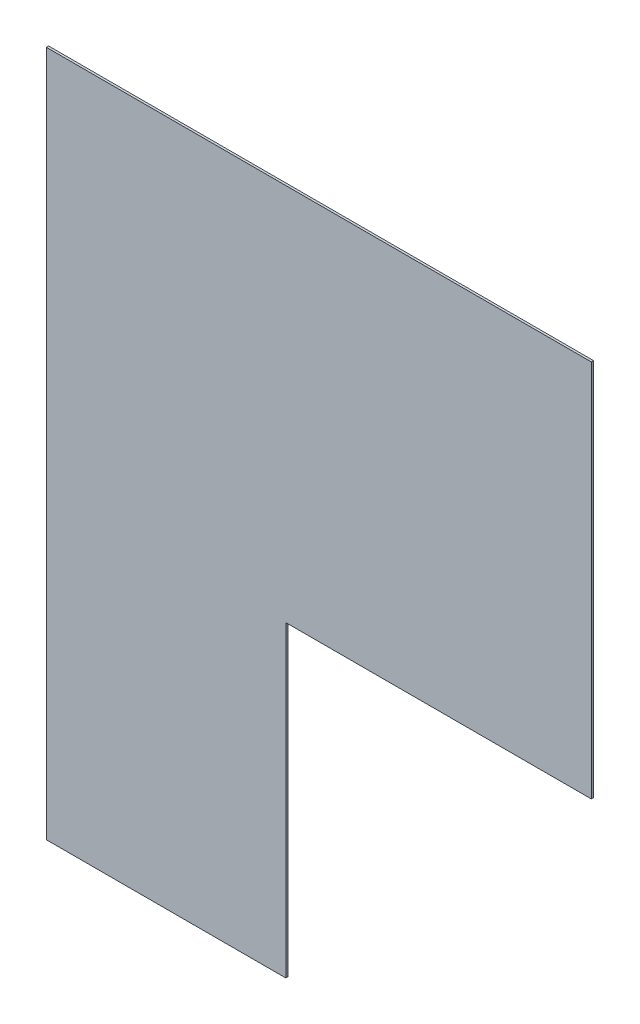
ISO-10303-21;
HEADER;
FILE_DESCRIPTION(('STEP AP214'),'2;1');
FILE_NAME('part.step','',(''),(''),'','','');
FILE_SCHEMA(('AUTOMOTIVE_DESIGN { 1 0 10303 214 1 1 1 1 }'));
ENDSEC;
DATA;
#1=APPLICATION_CONTEXT('core data for automotive mechanical design processes');
#2=APPLICATION_PROTOCOL_DEFINITION('international standard','automotive_design',2000,#1);
#3=PRODUCT_CONTEXT('',#1,'mechanical');
#4=PRODUCT('Part','Part','',(#3));
#5=PRODUCT_RELATED_PRODUCT_CATEGORY('part','',(#4));
#6=PRODUCT_DEFINITION_FORMATION('','',#4);
#7=PRODUCT_DEFINITION_CONTEXT('part definition',#1,'design');
#8=PRODUCT_DEFINITION('design','',#6,#7);
#9=PRODUCT_DEFINITION_SHAPE('','',#8);
#10=(LENGTH_UNIT() NAMED_UNIT(*) SI_UNIT(.MILLI.,.METRE.));
#11=(NAMED_UNIT(*) PLANE_ANGLE_UNIT() SI_UNIT($,.RADIAN.));
#12=(NAMED_UNIT(*) SI_UNIT($,.STERADIAN.) SOLID_ANGLE_UNIT());
#13=UNCERTAINTY_MEASURE_WITH_UNIT(LENGTH_MEASURE(1.E-05),#10,'distance_accuracy_value','');
#14=(GEOMETRIC_REPRESENTATION_CONTEXT(3) GLOBAL_UNCERTAINTY_ASSIGNED_CONTEXT((#13)) GLOBAL_UNIT_ASSIGNED_CONTEXT((#10,
#11,#12)) REPRESENTATION_CONTEXT('',''));
#15=CARTESIAN_POINT('',(0.,0.,0.));
#16=DIRECTION('',(0.,0.,1.));
#17=DIRECTION('',(1.,0.,0.));
#18=AXIS2_PLACEMENT_3D('',#15,#16,#17);
#19=CARTESIAN_POINT('',(0.,-1505.,-5.));
#20=DIRECTION('',(-1.,0.,0.));
#21=DIRECTION('',(0.,0.,1.));
#22=AXIS2_PLACEMENT_3D('',#19,#20,#21);
#23=PLANE('',#22);
#24=DIRECTION('',(0.,-1.,0.));
#25=VECTOR('',#24,1.);
#26=CARTESIAN_POINT('',(0.,-1505.,0.));
#27=LINE('',#26,#25);
#28=CARTESIAN_POINT('',(0.,0.,0.));
#29=VERTEX_POINT('',#28);
#30=CARTESIAN_POINT('',(0.,-1505.,0.));
#31=VERTEX_POINT('',#30);
#32=EDGE_CURVE('E125',#29,#31,#27,.T.);
#33=ORIENTED_EDGE('',*,*,#32,.F.);
#34=DIRECTION('',(0.,0.,1.));
#35=VECTOR('',#34,1.);
#36=CARTESIAN_POINT('',(0.,0.,-5.));
#37=LINE('',#36,#35);
#38=CARTESIAN_POINT('',(0.,0.,-5.));
#39=VERTEX_POINT('',#38);
#40=EDGE_CURVE('E61',#39,#29,#37,.T.);
#41=ORIENTED_EDGE('',*,*,#40,.F.);
#42=DIRECTION('',(0.,-1.,0.));
#43=VECTOR('',#42,1.);
#44=CARTESIAN_POINT('',(0.,-1505.,-5.));
#45=LINE('',#44,#43);
#46=CARTESIAN_POINT('',(0.,-1505.,-5.));
#47=VERTEX_POINT('',#46);
#48=EDGE_CURVE('E121',#39,#47,#45,.T.);
#49=ORIENTED_EDGE('',*,*,#48,.T.);
#50=DIRECTION('',(0.,0.,1.));
#51=VECTOR('',#50,1.);
#52=CARTESIAN_POINT('',(0.,-1505.,-5.));
#53=LINE('',#52,#51);
#54=EDGE_CURVE('E82',#47,#31,#53,.T.);
#55=ORIENTED_EDGE('',*,*,#54,.T.);
#56=EDGE_LOOP('',(#33,#41,#49,#55));
#57=FACE_BOUND('',#56,.T.);
#58=ADVANCED_FACE('F38',(#57),#23,.T.);
#59=CARTESIAN_POINT('',(0.,0.,-5.));
#60=DIRECTION('',(0.,1.,0.));
#61=DIRECTION('',(0.,0.,1.));
#62=AXIS2_PLACEMENT_3D('',#59,#60,#61);
#63=PLANE('',#62);
#64=DIRECTION('',(-1.,0.,0.));
#65=VECTOR('',#64,1.);
#66=CARTESIAN_POINT('',(0.,0.,0.));
#67=LINE('',#66,#65);
#68=CARTESIAN_POINT('',(1195.,0.,0.));
#69=VERTEX_POINT('',#68);
#70=EDGE_CURVE('E134',#69,#29,#67,.T.);
#71=ORIENTED_EDGE('',*,*,#70,.F.);
#72=DIRECTION('',(0.,0.,1.));
#73=VECTOR('',#72,1.);
#74=CARTESIAN_POINT('',(1195.,0.,-5.));
#75=LINE('',#74,#73);
#76=CARTESIAN_POINT('',(1195.,0.,-5.));
#77=VERTEX_POINT('',#76);
#78=EDGE_CURVE('E142',#77,#69,#75,.T.);
#79=ORIENTED_EDGE('',*,*,#78,.F.);
#80=DIRECTION('',(-1.,0.,0.));
#81=VECTOR('',#80,1.);
#82=CARTESIAN_POINT('',(0.,0.,-5.));
#83=LINE('',#82,#81);
#84=EDGE_CURVE('E117',#77,#39,#83,.T.);
#85=ORIENTED_EDGE('',*,*,#84,.T.);
#86=ORIENTED_EDGE('',*,*,#40,.T.);
#87=EDGE_LOOP('',(#71,#79,#85,#86));
#88=FACE_BOUND('',#87,.T.);
#89=ADVANCED_FACE('F163',(#88),#63,.T.);
#90=CARTESIAN_POINT('',(1195.,0.,-5.));
#91=DIRECTION('',(1.,0.,0.));
#92=DIRECTION('',(0.,1.,0.));
#93=AXIS2_PLACEMENT_3D('',#90,#91,#92);
#94=PLANE('',#93);
#95=DIRECTION('',(0.,0.,1.));
#96=VECTOR('',#95,1.);
#97=CARTESIAN_POINT('',(1195.,-830.,-5.));
#98=LINE('',#97,#96);
#99=CARTESIAN_POINT('',(1195.,-830.,-5.));
#100=VERTEX_POINT('',#99);
#101=CARTESIAN_POINT('',(1195.,-830.,0.));
#102=VERTEX_POINT('',#101);
#103=EDGE_CURVE('E52',#100,#102,#98,.T.);
#104=ORIENTED_EDGE('',*,*,#103,.F.);
#105=DIRECTION('',(0.,1.,0.));
#106=VECTOR('',#105,1.);
#107=CARTESIAN_POINT('',(1195.,0.,-5.));
#108=LINE('',#107,#106);
#109=EDGE_CURVE('E111',#100,#77,#108,.T.);
#110=ORIENTED_EDGE('',*,*,#109,.T.);
#111=ORIENTED_EDGE('',*,*,#78,.T.);
#112=DIRECTION('',(0.,1.,0.));
#113=VECTOR('',#112,1.);
#114=CARTESIAN_POINT('',(1195.,0.,0.));
#115=LINE('',#114,#113);
#116=EDGE_CURVE('E113',#102,#69,#115,.T.);
#117=ORIENTED_EDGE('',*,*,#116,.F.);
#118=EDGE_LOOP('',(#104,#110,#111,#117));
#119=FACE_BOUND('',#118,.T.);
#120=ADVANCED_FACE('F109',(#119),#94,.T.);
#121=CARTESIAN_POINT('',(1800.,-1505.,-5.));
#122=DIRECTION('',(0.,-1.,0.));
#123=DIRECTION('',(1.,0.,0.));
#124=AXIS2_PLACEMENT_3D('',#121,#122,#123);
#125=PLANE('',#124);
#126=DIRECTION('',(0.,0.,1.));
#127=VECTOR('',#126,1.);
#128=CARTESIAN_POINT('',(525.,-1505.,-5.));
#129=LINE('',#128,#127);
#130=CARTESIAN_POINT('',(525.,-1505.,-5.));
#131=VERTEX_POINT('',#130);
#132=CARTESIAN_POINT('',(525.,-1505.,0.));
#133=VERTEX_POINT('',#132);
#134=EDGE_CURVE('E129',#131,#133,#129,.T.);
#135=ORIENTED_EDGE('',*,*,#134,.T.);
#136=DIRECTION('',(1.,0.,0.));
#137=VECTOR('',#136,1.);
#138=CARTESIAN_POINT('',(1800.,-1505.,0.));
#139=LINE('',#138,#137);
#140=EDGE_CURVE('E128',#31,#133,#139,.T.);
#141=ORIENTED_EDGE('',*,*,#140,.F.);
#142=ORIENTED_EDGE('',*,*,#54,.F.);
#143=DIRECTION('',(1.,0.,0.));
#144=VECTOR('',#143,1.);
#145=CARTESIAN_POINT('',(1800.,-1505.,-5.));
#146=LINE('',#145,#144);
#147=EDGE_CURVE('E118',#47,#131,#146,.T.);
#148=ORIENTED_EDGE('',*,*,#147,.T.);
#149=EDGE_LOOP('',(#135,#141,#142,#148));
#150=FACE_BOUND('',#149,.T.);
#151=ADVANCED_FACE('F145',(#150),#125,.T.);
#152=CARTESIAN_POINT('',(0.,0.,-5.));
#153=DIRECTION('',(0.,0.,-1.));
#154=DIRECTION('',(-1.,0.,0.));
#155=AXIS2_PLACEMENT_3D('',#152,#153,#154);
#156=PLANE('',#155);
#157=DIRECTION('',(0.,-1.,0.));
#158=VECTOR('',#157,1.);
#159=CARTESIAN_POINT('',(525.,-1505.,-5.));
#160=LINE('',#159,#158);
#161=CARTESIAN_POINT('',(525.,-830.,-5.));
#162=VERTEX_POINT('',#161);
#163=EDGE_CURVE('E105',#162,#131,#160,.T.);
#164=ORIENTED_EDGE('',*,*,#163,.T.);
#165=ORIENTED_EDGE('',*,*,#147,.F.);
#166=ORIENTED_EDGE('',*,*,#48,.F.);
#167=ORIENTED_EDGE('',*,*,#84,.F.);
#168=ORIENTED_EDGE('',*,*,#109,.F.);
#169=DIRECTION('',(-1.,0.,0.));
#170=VECTOR('',#169,1.);
#171=CARTESIAN_POINT('',(525.,-830.,-5.));
#172=LINE('',#171,#170);
#173=EDGE_CURVE('E97',#100,#162,#172,.T.);
#174=ORIENTED_EDGE('',*,*,#173,.T.);
#175=EDGE_LOOP('',(#164,#165,#166,#167,#168,#174));
#176=FACE_BOUND('',#175,.T.);
#177=ADVANCED_FACE('F116',(#176),#156,.T.);
#178=CARTESIAN_POINT('',(0.,0.,0.));
#179=DIRECTION('',(0.,0.,-1.));
#180=DIRECTION('',(-1.,0.,0.));
#181=AXIS2_PLACEMENT_3D('',#178,#179,#180);
#182=PLANE('',#181);
#183=ORIENTED_EDGE('',*,*,#140,.T.);
#184=DIRECTION('',(0.,1.,0.));
#185=VECTOR('',#184,1.);
#186=CARTESIAN_POINT('',(525.,0.,0.));
#187=LINE('',#186,#185);
#188=CARTESIAN_POINT('',(525.,-830.,0.));
#189=VERTEX_POINT('',#188);
#190=EDGE_CURVE('E11',#133,#189,#187,.T.);
#191=ORIENTED_EDGE('',*,*,#190,.T.);
#192=DIRECTION('',(1.,0.,0.));
#193=VECTOR('',#192,1.);
#194=CARTESIAN_POINT('',(0.,-830.,0.));
#195=LINE('',#194,#193);
#196=EDGE_CURVE('E45',#189,#102,#195,.T.);
#197=ORIENTED_EDGE('',*,*,#196,.T.);
#198=ORIENTED_EDGE('',*,*,#116,.T.);
#199=ORIENTED_EDGE('',*,*,#70,.T.);
#200=ORIENTED_EDGE('',*,*,#32,.T.);
#201=EDGE_LOOP('',(#183,#191,#197,#198,#199,#200));
#202=FACE_BOUND('',#201,.T.);
#203=ADVANCED_FACE('F146',(#202),#182,.F.);
#204=CARTESIAN_POINT('',(525.,-1505.,-5.));
#205=DIRECTION('',(-1.,0.,0.));
#206=DIRECTION('',(0.,0.,1.));
#207=AXIS2_PLACEMENT_3D('',#204,#205,#206);
#208=PLANE('',#207);
#209=ORIENTED_EDGE('',*,*,#134,.F.);
#210=ORIENTED_EDGE('',*,*,#163,.F.);
#211=DIRECTION('',(0.,0.,1.));
#212=VECTOR('',#211,1.);
#213=CARTESIAN_POINT('',(525.,-830.,-5.));
#214=LINE('',#213,#212);
#215=EDGE_CURVE('E100',#162,#189,#214,.T.);
#216=ORIENTED_EDGE('',*,*,#215,.T.);
#217=ORIENTED_EDGE('',*,*,#190,.F.);
#218=EDGE_LOOP('',(#209,#210,#216,#217));
#219=FACE_BOUND('',#218,.T.);
#220=ADVANCED_FACE('F153',(#219),#208,.F.);
#221=CARTESIAN_POINT('',(525.,-830.,-5.));
#222=DIRECTION('',(0.,1.,0.));
#223=DIRECTION('',(0.,0.,1.));
#224=AXIS2_PLACEMENT_3D('',#221,#222,#223);
#225=PLANE('',#224);
#226=ORIENTED_EDGE('',*,*,#215,.F.);
#227=ORIENTED_EDGE('',*,*,#173,.F.);
#228=ORIENTED_EDGE('',*,*,#103,.T.);
#229=ORIENTED_EDGE('',*,*,#196,.F.);
#230=EDGE_LOOP('',(#226,#227,#228,#229));
#231=FACE_BOUND('',#230,.T.);
#232=ADVANCED_FACE('F98',(#231),#225,.F.);
#233=CLOSED_SHELL('',(#58,#89,#120,#151,#177,#203,#220,#232));
#234=MANIFOLD_SOLID_BREP('B2',#233);
#235=ADVANCED_BREP_SHAPE_REPRESENTATION('',(#18,#234),#14);
#236=SHAPE_DEFINITION_REPRESENTATION(#9,#235);
ENDSEC;
END-ISO-10303-21;
